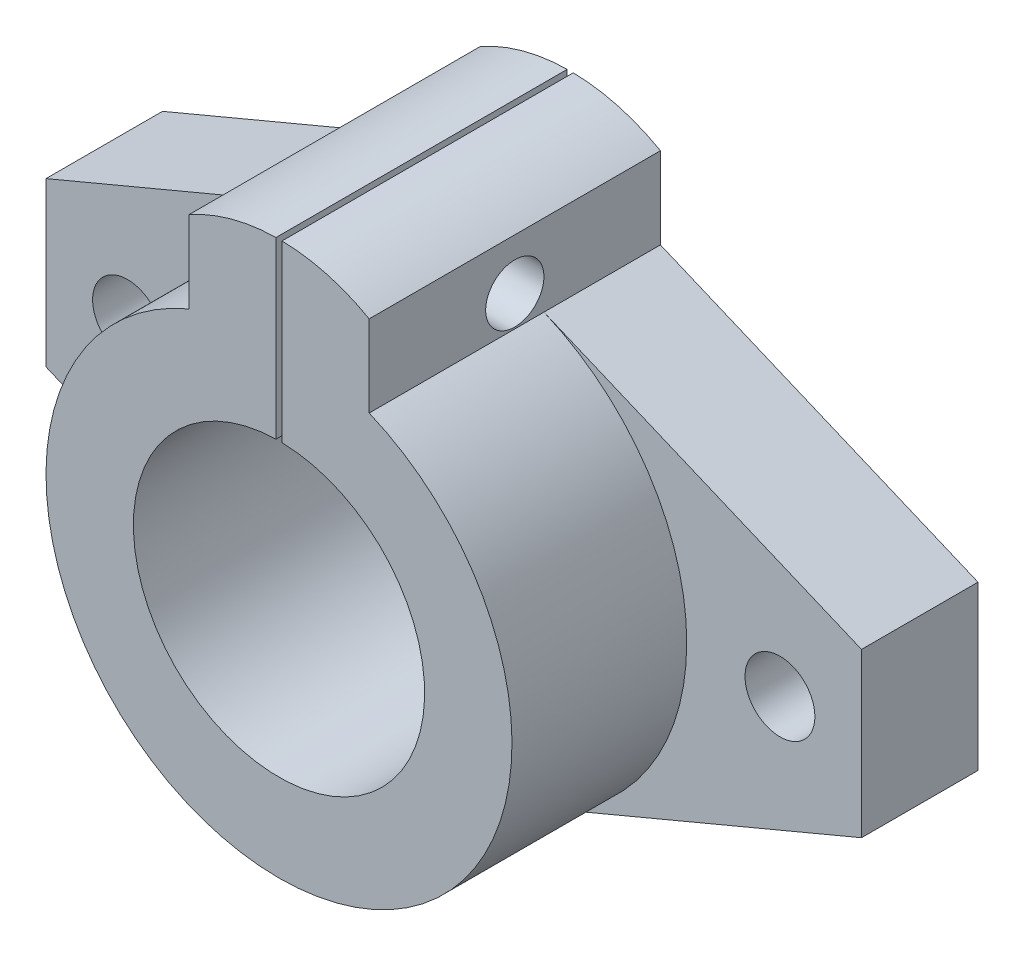
ISO-10303-21;
HEADER;
FILE_DESCRIPTION(('STEP AP214'),'2;1');
FILE_NAME('part.step','',(''),(''),'','','');
FILE_SCHEMA(('AUTOMOTIVE_DESIGN { 1 0 10303 214 1 1 1 1 }'));
ENDSEC;
DATA;
#1=APPLICATION_CONTEXT('core data for automotive mechanical design processes');
#2=APPLICATION_PROTOCOL_DEFINITION('international standard','automotive_design',2000,#1);
#3=PRODUCT_CONTEXT('',#1,'mechanical');
#4=PRODUCT('Part','Part','',(#3));
#5=PRODUCT_RELATED_PRODUCT_CATEGORY('part','',(#4));
#6=PRODUCT_DEFINITION_FORMATION('','',#4);
#7=PRODUCT_DEFINITION_CONTEXT('part definition',#1,'design');
#8=PRODUCT_DEFINITION('design','',#6,#7);
#9=PRODUCT_DEFINITION_SHAPE('','',#8);
#10=(LENGTH_UNIT() NAMED_UNIT(*) SI_UNIT(.MILLI.,.METRE.));
#11=(NAMED_UNIT(*) PLANE_ANGLE_UNIT() SI_UNIT($,.RADIAN.));
#12=(NAMED_UNIT(*) SI_UNIT($,.STERADIAN.) SOLID_ANGLE_UNIT());
#13=UNCERTAINTY_MEASURE_WITH_UNIT(LENGTH_MEASURE(1.E-05),#10,'distance_accuracy_value','');
#14=(GEOMETRIC_REPRESENTATION_CONTEXT(3) GLOBAL_UNCERTAINTY_ASSIGNED_CONTEXT((#13)) GLOBAL_UNIT_ASSIGNED_CONTEXT((#10,
#11,#12)) REPRESENTATION_CONTEXT('',''));
#15=CARTESIAN_POINT('',(0.,0.,0.));
#16=DIRECTION('',(0.,0.,1.));
#17=DIRECTION('',(1.,0.,0.));
#18=AXIS2_PLACEMENT_3D('',#15,#16,#17);
#19=CARTESIAN_POINT('',(0.,11.87489743787,10.));
#20=DIRECTION('',(0.,0.,-1.));
#21=DIRECTION('',(-1.,0.,0.));
#22=AXIS2_PLACEMENT_3D('',#19,#20,#21);
#23=CYLINDRICAL_SURFACE('',#22,15.6193467136848);
#24=DIRECTION('',(0.,0.,-1.));
#25=VECTOR('',#24,1.);
#26=CARTESIAN_POINT('',(-0.258597553957538,27.4921033040735,10.));
#27=LINE('',#26,#25);
#28=CARTESIAN_POINT('',(-0.258597553957538,27.4921033040735,0.));
#29=VERTEX_POINT('',#28);
#30=CARTESIAN_POINT('',(-0.258597553957538,27.4921033040735,25.));
#31=VERTEX_POINT('',#30);
#32=EDGE_CURVE('E59',#29,#31,#27,.F.);
#33=ORIENTED_EDGE('',*,*,#32,.F.);
#34=CARTESIAN_POINT('',(0.,11.87489743787,0.));
#35=DIRECTION('',(0.,0.,1.));
#36=DIRECTION('',(1.,0.,0.));
#37=AXIS2_PLACEMENT_3D('',#34,#35,#36);
#38=CIRCLE('',#37,15.6193467136848);
#39=CARTESIAN_POINT('',(-7.74027571439312,25.441478570472,0.));
#40=VERTEX_POINT('',#39);
#41=EDGE_CURVE('E253',#40,#29,#38,.F.);
#42=ORIENTED_EDGE('',*,*,#41,.F.);
#43=DIRECTION('',(0.,0.,-1.));
#44=VECTOR('',#43,1.);
#45=CARTESIAN_POINT('',(-7.74027571439312,25.441478570472,10.));
#46=LINE('',#45,#44);
#47=CARTESIAN_POINT('',(-7.74027571439312,25.441478570472,25.));
#48=VERTEX_POINT('',#47);
#49=EDGE_CURVE('E229',#48,#40,#46,.T.);
#50=ORIENTED_EDGE('',*,*,#49,.F.);
#51=CARTESIAN_POINT('',(0.,11.8748974378699,25.));
#52=DIRECTION('',(0.,0.,1.));
#53=DIRECTION('',(-1.,0.,0.));
#54=AXIS2_PLACEMENT_3D('',#51,#52,#53);
#55=CIRCLE('',#54,15.6193467136848);
#56=EDGE_CURVE('E164',#31,#48,#55,.T.);
#57=ORIENTED_EDGE('',*,*,#56,.F.);
#58=EDGE_LOOP('',(#33,#42,#50,#57));
#59=FACE_BOUND('',#58,.T.);
#60=ADVANCED_FACE('F36',(#59),#23,.T.);
#61=CARTESIAN_POINT('',(0.,0.,10.));
#62=DIRECTION('',(0.,0.,1.));
#63=DIRECTION('',(1.,0.,0.));
#64=AXIS2_PLACEMENT_3D('',#61,#62,#63);
#65=PLANE('',#64);
#66=CARTESIAN_POINT('',(0.,0.,10.));
#67=DIRECTION('',(0.,0.,1.));
#68=DIRECTION('',(1.,0.,0.));
#69=AXIS2_PLACEMENT_3D('',#66,#67,#68);
#70=CIRCLE('',#69,20.);
#71=CARTESIAN_POINT('',(-7.74027571439312,18.441478570472,10.));
#72=VERTEX_POINT('',#71);
#73=CARTESIAN_POINT('',(-7.74027571439311,-18.441478570472,10.));
#74=VERTEX_POINT('',#73);
#75=EDGE_CURVE('E177',#72,#74,#70,.T.);
#76=ORIENTED_EDGE('',*,*,#75,.F.);
#77=DIRECTION('',(0.922073928523597,0.387013785719656,0.));
#78=VECTOR('',#77,1.);
#79=CARTESIAN_POINT('',(-7.74027571439313,18.441478570472,10.));
#80=LINE('',#79,#78);
#81=CARTESIAN_POINT('',(-35.0000000000568,7.00000000013542,10.));
#82=VERTEX_POINT('',#81);
#83=EDGE_CURVE('E292',#82,#72,#80,.T.);
#84=ORIENTED_EDGE('',*,*,#83,.F.);
#85=DIRECTION('',(0.,1.,0.));
#86=VECTOR('',#85,1.);
#87=CARTESIAN_POINT('',(-35.0000000000568,0.,10.));
#88=LINE('',#87,#86);
#89=CARTESIAN_POINT('',(-35.0000000000568,-7.00000000013543,10.));
#90=VERTEX_POINT('',#89);
#91=EDGE_CURVE('E207',#90,#82,#88,.T.);
#92=ORIENTED_EDGE('',*,*,#91,.F.);
#93=DIRECTION('',(0.922073928523598,-0.387013785719656,0.));
#94=VECTOR('',#93,1.);
#95=CARTESIAN_POINT('',(-7.74027571439311,-18.441478570472,10.));
#96=LINE('',#95,#94);
#97=EDGE_CURVE('E203',#90,#74,#96,.T.);
#98=ORIENTED_EDGE('',*,*,#97,.T.);
#99=EDGE_LOOP('',(#76,#84,#92,#98));
#100=FACE_BOUND('',#99,.T.);
#101=CARTESIAN_POINT('',(-28.,0.,10.));
#102=DIRECTION('',(0.,0.,1.));
#103=DIRECTION('',(1.,0.,0.));
#104=AXIS2_PLACEMENT_3D('',#101,#102,#103);
#105=CIRCLE('',#104,3.);
#106=CARTESIAN_POINT('',(-25.,0.,10.));
#107=VERTEX_POINT('',#106);
#108=EDGE_CURVE('E250',#107,#107,#105,.T.);
#109=ORIENTED_EDGE('',*,*,#108,.F.);
#110=EDGE_LOOP('',(#109));
#111=FACE_BOUND('',#110,.T.);
#112=ADVANCED_FACE('F333',(#100,#111),#65,.T.);
#113=CARTESIAN_POINT('',(7.74027571439313,18.441478570472,10.));
#114=DIRECTION('',(-0.387013785719656,-0.922073928523597,0.));
#115=DIRECTION('',(0.922073928523597,-0.387013785719656,0.));
#116=AXIS2_PLACEMENT_3D('',#113,#114,#115);
#117=PLANE('',#116);
#118=DIRECTION('',(-0.922073928523597,0.387013785719656,0.));
#119=VECTOR('',#118,1.);
#120=CARTESIAN_POINT('',(7.74027571439313,18.441478570472,0.));
#121=LINE('',#120,#119);
#122=CARTESIAN_POINT('',(35.0000000000568,7.00000000013542,0.));
#123=VERTEX_POINT('',#122);
#124=CARTESIAN_POINT('',(7.74027571439312,18.441478570472,0.));
#125=VERTEX_POINT('',#124);
#126=EDGE_CURVE('E176',#123,#125,#121,.T.);
#127=ORIENTED_EDGE('',*,*,#126,.T.);
#128=DIRECTION('',(0.,0.,-1.));
#129=VECTOR('',#128,1.);
#130=CARTESIAN_POINT('',(7.74027571439312,18.441478570472,10.));
#131=LINE('',#130,#129);
#132=CARTESIAN_POINT('',(7.74027571439312,18.441478570472,10.));
#133=VERTEX_POINT('',#132);
#134=EDGE_CURVE('E188',#133,#125,#131,.T.);
#135=ORIENTED_EDGE('',*,*,#134,.F.);
#136=DIRECTION('',(-0.922073928523597,0.387013785719656,0.));
#137=VECTOR('',#136,1.);
#138=CARTESIAN_POINT('',(7.74027571439313,18.441478570472,10.));
#139=LINE('',#138,#137);
#140=CARTESIAN_POINT('',(35.0000000000568,7.00000000013542,10.));
#141=VERTEX_POINT('',#140);
#142=EDGE_CURVE('E183',#141,#133,#139,.T.);
#143=ORIENTED_EDGE('',*,*,#142,.F.);
#144=DIRECTION('',(0.,0.,-1.));
#145=VECTOR('',#144,1.);
#146=CARTESIAN_POINT('',(35.0000000000568,7.00000000013542,10.));
#147=LINE('',#146,#145);
#148=EDGE_CURVE('E244',#141,#123,#147,.T.);
#149=ORIENTED_EDGE('',*,*,#148,.T.);
#150=EDGE_LOOP('',(#127,#135,#143,#149));
#151=FACE_BOUND('',#150,.T.);
#152=ADVANCED_FACE('F38',(#151),#117,.F.);
#153=CARTESIAN_POINT('',(7.74027571439312,0.,10.));
#154=DIRECTION('',(-1.,0.,0.));
#155=DIRECTION('',(0.,0.,1.));
#156=AXIS2_PLACEMENT_3D('',#153,#154,#155);
#157=PLANE('',#156);
#158=CARTESIAN_POINT('',(7.74027571439312,21.0864235760214,12.5));
#159=DIRECTION('',(1.,0.,0.));
#160=DIRECTION('',(0.,0.,-1.));
#161=AXIS2_PLACEMENT_3D('',#158,#159,#160);
#162=CIRCLE('',#161,2.5);
#163=CARTESIAN_POINT('',(7.74027571439312,21.0864235760214,10.));
#164=VERTEX_POINT('',#163);
#165=EDGE_CURVE('E363',#164,#164,#162,.T.);
#166=ORIENTED_EDGE('',*,*,#165,.F.);
#167=EDGE_LOOP('',(#166));
#168=FACE_BOUND('',#167,.T.);
#169=DIRECTION('',(0.,1.,0.));
#170=VECTOR('',#169,1.);
#171=CARTESIAN_POINT('',(7.74027571439312,0.,0.));
#172=LINE('',#171,#170);
#173=CARTESIAN_POINT('',(7.74027571439312,25.441478570472,0.));
#174=VERTEX_POINT('',#173);
#175=EDGE_CURVE('E236',#125,#174,#172,.T.);
#176=ORIENTED_EDGE('',*,*,#175,.T.);
#177=DIRECTION('',(0.,0.,-1.));
#178=VECTOR('',#177,1.);
#179=CARTESIAN_POINT('',(7.74027571439312,25.441478570472,10.));
#180=LINE('',#179,#178);
#181=CARTESIAN_POINT('',(7.74027571439312,25.441478570472,25.));
#182=VERTEX_POINT('',#181);
#183=EDGE_CURVE('E230',#182,#174,#180,.T.);
#184=ORIENTED_EDGE('',*,*,#183,.F.);
#185=DIRECTION('',(0.,1.,0.));
#186=VECTOR('',#185,1.);
#187=CARTESIAN_POINT('',(7.74027571439312,18.441478570472,25.));
#188=LINE('',#187,#186);
#189=CARTESIAN_POINT('',(7.74027571439312,18.441478570472,25.));
#190=VERTEX_POINT('',#189);
#191=EDGE_CURVE('E162',#190,#182,#188,.T.);
#192=ORIENTED_EDGE('',*,*,#191,.F.);
#193=DIRECTION('',(0.,0.,-1.));
#194=VECTOR('',#193,1.);
#195=CARTESIAN_POINT('',(7.74027571439312,18.441478570472,25.));
#196=LINE('',#195,#194);
#197=EDGE_CURVE('E173',#190,#133,#196,.T.);
#198=ORIENTED_EDGE('',*,*,#197,.T.);
#199=ORIENTED_EDGE('',*,*,#134,.T.);
#200=EDGE_LOOP('',(#176,#184,#192,#198,#199));
#201=FACE_BOUND('',#200,.T.);
#202=ADVANCED_FACE('F235',(#168,#201),#157,.F.);
#203=DIRECTION('',(0.,0.,-1.));
#204=VECTOR('',#203,1.);
#205=CARTESIAN_POINT('',(0.258597553957538,27.4921033040735,10.));
#206=LINE('',#205,#204);
#207=CARTESIAN_POINT('',(0.258597553957538,27.4921033040735,25.));
#208=VERTEX_POINT('',#207);
#209=CARTESIAN_POINT('',(0.258597553957538,27.4921033040735,0.));
#210=VERTEX_POINT('',#209);
#211=EDGE_CURVE('E142',#208,#210,#206,.T.);
#212=ORIENTED_EDGE('',*,*,#211,.F.);
#213=EDGE_CURVE('E155',#182,#208,#55,.T.);
#214=ORIENTED_EDGE('',*,*,#213,.F.);
#215=ORIENTED_EDGE('',*,*,#183,.T.);
#216=EDGE_CURVE('E156',#210,#174,#38,.F.);
#217=ORIENTED_EDGE('',*,*,#216,.F.);
#218=EDGE_LOOP('',(#212,#214,#215,#217));
#219=FACE_BOUND('',#218,.T.);
#220=ADVANCED_FACE('F153',(#219),#23,.T.);
#221=CARTESIAN_POINT('',(-7.74027571439312,0.,10.));
#222=DIRECTION('',(-1.,0.,0.));
#223=DIRECTION('',(0.,0.,1.));
#224=AXIS2_PLACEMENT_3D('',#221,#222,#223);
#225=PLANE('',#224);
#226=CARTESIAN_POINT('',(-7.74027571439312,21.0864235760214,12.5));
#227=DIRECTION('',(-1.,0.,0.));
#228=DIRECTION('',(0.,0.,1.));
#229=AXIS2_PLACEMENT_3D('',#226,#227,#228);
#230=CIRCLE('',#229,2.5);
#231=CARTESIAN_POINT('',(-7.74027571439312,21.0864235760214,15.));
#232=VERTEX_POINT('',#231);
#233=EDGE_CURVE('E371',#232,#232,#230,.T.);
#234=ORIENTED_EDGE('',*,*,#233,.F.);
#235=EDGE_LOOP('',(#234));
#236=FACE_BOUND('',#235,.T.);
#237=DIRECTION('',(0.,1.,0.));
#238=VECTOR('',#237,1.);
#239=CARTESIAN_POINT('',(-7.74027571439312,0.,0.));
#240=LINE('',#239,#238);
#241=CARTESIAN_POINT('',(-7.74027571439312,18.441478570472,0.));
#242=VERTEX_POINT('',#241);
#243=EDGE_CURVE('E256',#242,#40,#240,.T.);
#244=ORIENTED_EDGE('',*,*,#243,.F.);
#245=DIRECTION('',(0.,0.,-1.));
#246=VECTOR('',#245,1.);
#247=CARTESIAN_POINT('',(-7.74027571439312,18.441478570472,10.));
#248=LINE('',#247,#246);
#249=EDGE_CURVE('E223',#72,#242,#248,.T.);
#250=ORIENTED_EDGE('',*,*,#249,.F.);
#251=DIRECTION('',(0.,0.,-1.));
#252=VECTOR('',#251,1.);
#253=CARTESIAN_POINT('',(-7.74027571439312,18.441478570472,25.));
#254=LINE('',#253,#252);
#255=CARTESIAN_POINT('',(-7.74027571439312,18.441478570472,25.));
#256=VERTEX_POINT('',#255);
#257=EDGE_CURVE('E166',#256,#72,#254,.T.);
#258=ORIENTED_EDGE('',*,*,#257,.F.);
#259=DIRECTION('',(0.,-1.,0.));
#260=VECTOR('',#259,1.);
#261=CARTESIAN_POINT('',(-7.74027571439312,18.441478570472,25.));
#262=LINE('',#261,#260);
#263=EDGE_CURVE('E163',#48,#256,#262,.T.);
#264=ORIENTED_EDGE('',*,*,#263,.F.);
#265=ORIENTED_EDGE('',*,*,#49,.T.);
#266=EDGE_LOOP('',(#244,#250,#258,#264,#265));
#267=FACE_BOUND('',#266,.T.);
#268=ADVANCED_FACE('F321',(#236,#267),#225,.T.);
#269=CARTESIAN_POINT('',(-7.74027571439313,18.441478570472,10.));
#270=DIRECTION('',(-0.387013785719656,0.922073928523597,0.));
#271=DIRECTION('',(-0.922073928523597,-0.387013785719656,0.));
#272=AXIS2_PLACEMENT_3D('',#269,#270,#271);
#273=PLANE('',#272);
#274=DIRECTION('',(0.922073928523597,0.387013785719656,0.));
#275=VECTOR('',#274,1.);
#276=CARTESIAN_POINT('',(-7.74027571439313,18.441478570472,0.));
#277=LINE('',#276,#275);
#278=CARTESIAN_POINT('',(-35.0000000000568,7.00000000013542,0.));
#279=VERTEX_POINT('',#278);
#280=EDGE_CURVE('E259',#279,#242,#277,.T.);
#281=ORIENTED_EDGE('',*,*,#280,.F.);
#282=DIRECTION('',(0.,0.,-1.));
#283=VECTOR('',#282,1.);
#284=CARTESIAN_POINT('',(-35.0000000000568,7.00000000013542,10.));
#285=LINE('',#284,#283);
#286=EDGE_CURVE('E218',#82,#279,#285,.T.);
#287=ORIENTED_EDGE('',*,*,#286,.F.);
#288=ORIENTED_EDGE('',*,*,#83,.T.);
#289=ORIENTED_EDGE('',*,*,#249,.T.);
#290=EDGE_LOOP('',(#281,#287,#288,#289));
#291=FACE_BOUND('',#290,.T.);
#292=ADVANCED_FACE('F315',(#291),#273,.T.);
#293=CARTESIAN_POINT('',(-35.0000000000568,0.,10.));
#294=DIRECTION('',(-1.,0.,0.));
#295=DIRECTION('',(0.,0.,1.));
#296=AXIS2_PLACEMENT_3D('',#293,#294,#295);
#297=PLANE('',#296);
#298=DIRECTION('',(0.,1.,0.));
#299=VECTOR('',#298,1.);
#300=CARTESIAN_POINT('',(-35.0000000000568,0.,0.));
#301=LINE('',#300,#299);
#302=CARTESIAN_POINT('',(-35.0000000000568,-7.00000000013543,0.));
#303=VERTEX_POINT('',#302);
#304=EDGE_CURVE('E262',#303,#279,#301,.T.);
#305=ORIENTED_EDGE('',*,*,#304,.F.);
#306=DIRECTION('',(0.,0.,-1.));
#307=VECTOR('',#306,1.);
#308=CARTESIAN_POINT('',(-35.0000000000568,-7.00000000013543,10.));
#309=LINE('',#308,#307);
#310=EDGE_CURVE('E212',#90,#303,#309,.T.);
#311=ORIENTED_EDGE('',*,*,#310,.F.);
#312=ORIENTED_EDGE('',*,*,#91,.T.);
#313=ORIENTED_EDGE('',*,*,#286,.T.);
#314=EDGE_LOOP('',(#305,#311,#312,#313));
#315=FACE_BOUND('',#314,.T.);
#316=ADVANCED_FACE('F312',(#315),#297,.T.);
#317=CARTESIAN_POINT('',(-7.74027571439311,-18.441478570472,10.));
#318=DIRECTION('',(0.387013785719656,0.922073928523598,0.));
#319=DIRECTION('',(-0.922073928523598,0.387013785719656,0.));
#320=AXIS2_PLACEMENT_3D('',#317,#318,#319);
#321=PLANE('',#320);
#322=DIRECTION('',(0.922073928523598,-0.387013785719656,0.));
#323=VECTOR('',#322,1.);
#324=CARTESIAN_POINT('',(-7.74027571439311,-18.441478570472,0.));
#325=LINE('',#324,#323);
#326=CARTESIAN_POINT('',(-7.74027571439311,-18.441478570472,0.));
#327=VERTEX_POINT('',#326);
#328=EDGE_CURVE('E265',#303,#327,#325,.T.);
#329=ORIENTED_EDGE('',*,*,#328,.T.);
#330=DIRECTION('',(0.,0.,-1.));
#331=VECTOR('',#330,1.);
#332=CARTESIAN_POINT('',(-7.74027571439311,-18.441478570472,10.));
#333=LINE('',#332,#331);
#334=EDGE_CURVE('E195',#74,#327,#333,.T.);
#335=ORIENTED_EDGE('',*,*,#334,.F.);
#336=ORIENTED_EDGE('',*,*,#97,.F.);
#337=ORIENTED_EDGE('',*,*,#310,.T.);
#338=EDGE_LOOP('',(#329,#335,#336,#337));
#339=FACE_BOUND('',#338,.T.);
#340=ADVANCED_FACE('F335',(#339),#321,.F.);
#341=CARTESIAN_POINT('',(0.,0.,10.));
#342=DIRECTION('',(0.,0.,-1.));
#343=DIRECTION('',(-1.,0.,0.));
#344=AXIS2_PLACEMENT_3D('',#341,#342,#343);
#345=CYLINDRICAL_SURFACE('',#344,20.);
#346=CARTESIAN_POINT('',(0.,0.,0.));
#347=DIRECTION('',(0.,0.,1.));
#348=DIRECTION('',(1.,0.,0.));
#349=AXIS2_PLACEMENT_3D('',#346,#347,#348);
#350=CIRCLE('',#349,20.);
#351=CARTESIAN_POINT('',(7.74027571439311,-18.441478570472,0.));
#352=VERTEX_POINT('',#351);
#353=EDGE_CURVE('E267',#327,#352,#350,.T.);
#354=ORIENTED_EDGE('',*,*,#353,.T.);
#355=DIRECTION('',(0.,0.,-1.));
#356=VECTOR('',#355,1.);
#357=CARTESIAN_POINT('',(7.74027571439311,-18.441478570472,10.));
#358=LINE('',#357,#356);
#359=CARTESIAN_POINT('',(7.74027571439311,-18.441478570472,10.));
#360=VERTEX_POINT('',#359);
#361=EDGE_CURVE('E193',#360,#352,#358,.T.);
#362=ORIENTED_EDGE('',*,*,#361,.F.);
#363=EDGE_CURVE('E148',#360,#133,#70,.T.);
#364=ORIENTED_EDGE('',*,*,#363,.T.);
#365=ORIENTED_EDGE('',*,*,#197,.F.);
#366=CARTESIAN_POINT('',(0.,0.,25.));
#367=DIRECTION('',(0.,0.,1.));
#368=DIRECTION('',(1.,0.,0.));
#369=AXIS2_PLACEMENT_3D('',#366,#367,#368);
#370=CIRCLE('',#369,20.);
#371=EDGE_CURVE('E181',#256,#190,#370,.T.);
#372=ORIENTED_EDGE('',*,*,#371,.F.);
#373=ORIENTED_EDGE('',*,*,#257,.T.);
#374=ORIENTED_EDGE('',*,*,#75,.T.);
#375=ORIENTED_EDGE('',*,*,#334,.T.);
#376=EDGE_LOOP('',(#354,#362,#364,#365,#372,#373,#374,#375));
#377=FACE_BOUND('',#376,.T.);
#378=ADVANCED_FACE('F301',(#377),#345,.T.);
#379=CARTESIAN_POINT('',(7.74027571439311,-18.441478570472,10.));
#380=DIRECTION('',(0.387013785719656,-0.922073928523598,0.));
#381=DIRECTION('',(0.922073928523598,0.387013785719656,0.));
#382=AXIS2_PLACEMENT_3D('',#379,#380,#381);
#383=PLANE('',#382);
#384=DIRECTION('',(-0.922073928523598,-0.387013785719656,0.));
#385=VECTOR('',#384,1.);
#386=CARTESIAN_POINT('',(7.74027571439311,-18.441478570472,0.));
#387=LINE('',#386,#385);
#388=CARTESIAN_POINT('',(35.0000000000568,-7.00000000013543,0.));
#389=VERTEX_POINT('',#388);
#390=EDGE_CURVE('E269',#389,#352,#387,.T.);
#391=ORIENTED_EDGE('',*,*,#390,.F.);
#392=DIRECTION('',(0.,0.,-1.));
#393=VECTOR('',#392,1.);
#394=CARTESIAN_POINT('',(35.0000000000568,-7.00000000013543,10.));
#395=LINE('',#394,#393);
#396=CARTESIAN_POINT('',(35.0000000000568,-7.00000000013543,10.));
#397=VERTEX_POINT('',#396);
#398=EDGE_CURVE('E196',#397,#389,#395,.T.);
#399=ORIENTED_EDGE('',*,*,#398,.F.);
#400=DIRECTION('',(-0.922073928523598,-0.387013785719656,0.));
#401=VECTOR('',#400,1.);
#402=CARTESIAN_POINT('',(7.74027571439311,-18.441478570472,10.));
#403=LINE('',#402,#401);
#404=EDGE_CURVE('E199',#397,#360,#403,.T.);
#405=ORIENTED_EDGE('',*,*,#404,.T.);
#406=ORIENTED_EDGE('',*,*,#361,.T.);
#407=EDGE_LOOP('',(#391,#399,#405,#406));
#408=FACE_BOUND('',#407,.T.);
#409=ADVANCED_FACE('F305',(#408),#383,.T.);
#410=CARTESIAN_POINT('',(0.,0.,10.));
#411=DIRECTION('',(0.,0.,-1.));
#412=DIRECTION('',(-1.,0.,0.));
#413=AXIS2_PLACEMENT_3D('',#410,#411,#412);
#414=CYLINDRICAL_SURFACE('',#413,12.5);
#415=DIRECTION('',(0.,0.,-1.));
#416=VECTOR('',#415,1.);
#417=CARTESIAN_POINT('',(-0.258597553957538,12.497324805937,10.));
#418=LINE('',#417,#416);
#419=CARTESIAN_POINT('',(-0.258597553957538,12.497324805937,25.));
#420=VERTEX_POINT('',#419);
#421=CARTESIAN_POINT('',(-0.258597553957538,12.497324805937,0.));
#422=VERTEX_POINT('',#421);
#423=EDGE_CURVE('E327',#420,#422,#418,.T.);
#424=ORIENTED_EDGE('',*,*,#423,.F.);
#425=CARTESIAN_POINT('',(0.,0.,25.));
#426=DIRECTION('',(0.,0.,1.));
#427=DIRECTION('',(1.,0.,0.));
#428=AXIS2_PLACEMENT_3D('',#425,#426,#427);
#429=CIRCLE('',#428,12.5);
#430=CARTESIAN_POINT('',(0.258597553957538,12.497324805937,25.));
#431=VERTEX_POINT('',#430);
#432=EDGE_CURVE('E182',#420,#431,#429,.T.);
#433=ORIENTED_EDGE('',*,*,#432,.T.);
#434=DIRECTION('',(0.,0.,-1.));
#435=VECTOR('',#434,1.);
#436=CARTESIAN_POINT('',(0.258597553957538,12.497324805937,10.));
#437=LINE('',#436,#435);
#438=CARTESIAN_POINT('',(0.258597553957538,12.497324805937,0.));
#439=VERTEX_POINT('',#438);
#440=EDGE_CURVE('E52',#439,#431,#437,.F.);
#441=ORIENTED_EDGE('',*,*,#440,.F.);
#442=CARTESIAN_POINT('',(0.,0.,0.));
#443=DIRECTION('',(0.,0.,1.));
#444=DIRECTION('',(1.,0.,0.));
#445=AXIS2_PLACEMENT_3D('',#442,#443,#444);
#446=CIRCLE('',#445,12.5);
#447=EDGE_CURVE('E277',#422,#439,#446,.T.);
#448=ORIENTED_EDGE('',*,*,#447,.F.);
#449=EDGE_LOOP('',(#424,#433,#441,#448));
#450=FACE_BOUND('',#449,.T.);
#451=ADVANCED_FACE('F379',(#450),#414,.F.);
#452=CARTESIAN_POINT('',(28.,0.,10.));
#453=DIRECTION('',(0.,0.,-1.));
#454=DIRECTION('',(-1.,0.,0.));
#455=AXIS2_PLACEMENT_3D('',#452,#453,#454);
#456=CYLINDRICAL_SURFACE('',#455,3.);
#457=CARTESIAN_POINT('',(28.,0.,10.));
#458=DIRECTION('',(0.,0.,1.));
#459=DIRECTION('',(1.,0.,0.));
#460=AXIS2_PLACEMENT_3D('',#457,#458,#459);
#461=CIRCLE('',#460,3.);
#462=CARTESIAN_POINT('',(31.,0.,10.));
#463=VERTEX_POINT('',#462);
#464=EDGE_CURVE('E283',#463,#463,#461,.F.);
#465=ORIENTED_EDGE('',*,*,#464,.F.);
#466=EDGE_LOOP('',(#465));
#467=FACE_BOUND('',#466,.T.);
#468=CARTESIAN_POINT('',(28.,0.,0.));
#469=DIRECTION('',(0.,0.,1.));
#470=DIRECTION('',(1.,0.,0.));
#471=AXIS2_PLACEMENT_3D('',#468,#469,#470);
#472=CIRCLE('',#471,3.);
#473=CARTESIAN_POINT('',(31.,0.,0.));
#474=VERTEX_POINT('',#473);
#475=EDGE_CURVE('E274',#474,#474,#472,.F.);
#476=ORIENTED_EDGE('',*,*,#475,.T.);
#477=EDGE_LOOP('',(#476));
#478=FACE_BOUND('',#477,.T.);
#479=ADVANCED_FACE('F406',(#467,#478),#456,.F.);
#480=CARTESIAN_POINT('',(35.0000000000568,0.,10.));
#481=DIRECTION('',(-1.,0.,0.));
#482=DIRECTION('',(0.,0.,1.));
#483=AXIS2_PLACEMENT_3D('',#480,#481,#482);
#484=PLANE('',#483);
#485=DIRECTION('',(0.,1.,0.));
#486=VECTOR('',#485,1.);
#487=CARTESIAN_POINT('',(35.0000000000568,0.,0.));
#488=LINE('',#487,#486);
#489=EDGE_CURVE('E272',#389,#123,#488,.T.);
#490=ORIENTED_EDGE('',*,*,#489,.T.);
#491=ORIENTED_EDGE('',*,*,#148,.F.);
#492=DIRECTION('',(0.,1.,0.));
#493=VECTOR('',#492,1.);
#494=CARTESIAN_POINT('',(35.0000000000568,0.,10.));
#495=LINE('',#494,#493);
#496=EDGE_CURVE('E202',#397,#141,#495,.T.);
#497=ORIENTED_EDGE('',*,*,#496,.F.);
#498=ORIENTED_EDGE('',*,*,#398,.T.);
#499=EDGE_LOOP('',(#490,#491,#497,#498));
#500=FACE_BOUND('',#499,.T.);
#501=ADVANCED_FACE('F307',(#500),#484,.F.);
#502=CARTESIAN_POINT('',(-28.,0.,10.));
#503=DIRECTION('',(0.,0.,-1.));
#504=DIRECTION('',(-1.,0.,0.));
#505=AXIS2_PLACEMENT_3D('',#502,#503,#504);
#506=CYLINDRICAL_SURFACE('',#505,3.);
#507=ORIENTED_EDGE('',*,*,#108,.T.);
#508=EDGE_LOOP('',(#507));
#509=FACE_BOUND('',#508,.T.);
#510=CARTESIAN_POINT('',(-28.,0.,0.));
#511=DIRECTION('',(0.,0.,1.));
#512=DIRECTION('',(1.,0.,0.));
#513=AXIS2_PLACEMENT_3D('',#510,#511,#512);
#514=CIRCLE('',#513,3.);
#515=CARTESIAN_POINT('',(-25.,0.,0.));
#516=VERTEX_POINT('',#515);
#517=EDGE_CURVE('E280',#516,#516,#514,.T.);
#518=ORIENTED_EDGE('',*,*,#517,.F.);
#519=EDGE_LOOP('',(#518));
#520=FACE_BOUND('',#519,.T.);
#521=ADVANCED_FACE('F398',(#509,#520),#506,.F.);
#522=ORIENTED_EDGE('',*,*,#363,.F.);
#523=ORIENTED_EDGE('',*,*,#404,.F.);
#524=ORIENTED_EDGE('',*,*,#496,.T.);
#525=ORIENTED_EDGE('',*,*,#142,.T.);
#526=EDGE_LOOP('',(#522,#523,#524,#525));
#527=FACE_BOUND('',#526,.T.);
#528=ORIENTED_EDGE('',*,*,#464,.T.);
#529=EDGE_LOOP('',(#528));
#530=FACE_BOUND('',#529,.T.);
#531=ADVANCED_FACE('F297',(#527,#530),#65,.T.);
#532=CARTESIAN_POINT('',(0.,0.,0.));
#533=DIRECTION('',(0.,0.,1.));
#534=DIRECTION('',(1.,0.,0.));
#535=AXIS2_PLACEMENT_3D('',#532,#533,#534);
#536=PLANE('',#535);
#537=ORIENTED_EDGE('',*,*,#475,.F.);
#538=EDGE_LOOP('',(#537));
#539=FACE_BOUND('',#538,.T.);
#540=ORIENTED_EDGE('',*,*,#41,.T.);
#541=DIRECTION('',(0.,-1.,0.));
#542=VECTOR('',#541,1.);
#543=CARTESIAN_POINT('',(-0.258597553957538,0.,0.));
#544=LINE('',#543,#542);
#545=EDGE_CURVE('E157',#29,#422,#544,.T.);
#546=ORIENTED_EDGE('',*,*,#545,.T.);
#547=ORIENTED_EDGE('',*,*,#447,.T.);
#548=DIRECTION('',(0.,1.,0.));
#549=VECTOR('',#548,1.);
#550=CARTESIAN_POINT('',(0.258597553957538,0.,0.));
#551=LINE('',#550,#549);
#552=EDGE_CURVE('E374',#439,#210,#551,.T.);
#553=ORIENTED_EDGE('',*,*,#552,.T.);
#554=ORIENTED_EDGE('',*,*,#216,.T.);
#555=ORIENTED_EDGE('',*,*,#175,.F.);
#556=ORIENTED_EDGE('',*,*,#126,.F.);
#557=ORIENTED_EDGE('',*,*,#489,.F.);
#558=ORIENTED_EDGE('',*,*,#390,.T.);
#559=ORIENTED_EDGE('',*,*,#353,.F.);
#560=ORIENTED_EDGE('',*,*,#328,.F.);
#561=ORIENTED_EDGE('',*,*,#304,.T.);
#562=ORIENTED_EDGE('',*,*,#280,.T.);
#563=ORIENTED_EDGE('',*,*,#243,.T.);
#564=EDGE_LOOP('',(#540,#546,#547,#553,#554,#555,#556,#557,#558,#559,#560,#561,#562,#563));
#565=FACE_BOUND('',#564,.T.);
#566=ORIENTED_EDGE('',*,*,#517,.T.);
#567=EDGE_LOOP('',(#566));
#568=FACE_BOUND('',#567,.T.);
#569=ADVANCED_FACE('F308',(#539,#565,#568),#536,.F.);
#570=CARTESIAN_POINT('',(0.,0.,25.));
#571=DIRECTION('',(0.,0.,1.));
#572=DIRECTION('',(1.,0.,0.));
#573=AXIS2_PLACEMENT_3D('',#570,#571,#572);
#574=PLANE('',#573);
#575=DIRECTION('',(0.,-1.,0.));
#576=VECTOR('',#575,1.);
#577=CARTESIAN_POINT('',(-0.258597553957538,0.,25.));
#578=LINE('',#577,#576);
#579=EDGE_CURVE('E11',#31,#420,#578,.T.);
#580=ORIENTED_EDGE('',*,*,#579,.F.);
#581=ORIENTED_EDGE('',*,*,#56,.T.);
#582=ORIENTED_EDGE('',*,*,#263,.T.);
#583=ORIENTED_EDGE('',*,*,#371,.T.);
#584=ORIENTED_EDGE('',*,*,#191,.T.);
#585=ORIENTED_EDGE('',*,*,#213,.T.);
#586=DIRECTION('',(0.,1.,0.));
#587=VECTOR('',#586,1.);
#588=CARTESIAN_POINT('',(0.258597553957538,0.,25.));
#589=LINE('',#588,#587);
#590=EDGE_CURVE('E45',#431,#208,#589,.T.);
#591=ORIENTED_EDGE('',*,*,#590,.F.);
#592=ORIENTED_EDGE('',*,*,#432,.F.);
#593=EDGE_LOOP('',(#580,#581,#582,#583,#584,#585,#591,#592));
#594=FACE_BOUND('',#593,.T.);
#595=ADVANCED_FACE('F160',(#594),#574,.T.);
#596=CARTESIAN_POINT('',(0.258597553957538,12.3781063786396,-2.50000000007189E-05));
#597=DIRECTION('',(1.,0.,0.));
#598=DIRECTION('',(0.,0.,-1.));
#599=AXIS2_PLACEMENT_3D('',#596,#597,#598);
#600=PLANE('',#599);
#601=CARTESIAN_POINT('',(0.258597553957539,21.0864235760214,12.5));
#602=DIRECTION('',(1.,0.,0.));
#603=DIRECTION('',(0.,0.,-1.));
#604=AXIS2_PLACEMENT_3D('',#601,#602,#603);
#605=CIRCLE('',#604,2.5);
#606=CARTESIAN_POINT('',(0.258597553957539,21.0864235760214,10.));
#607=VERTEX_POINT('',#606);
#608=EDGE_CURVE('E367',#607,#607,#605,.T.);
#609=ORIENTED_EDGE('',*,*,#608,.T.);
#610=EDGE_LOOP('',(#609));
#611=FACE_BOUND('',#610,.T.);
#612=ORIENTED_EDGE('',*,*,#211,.T.);
#613=ORIENTED_EDGE('',*,*,#552,.F.);
#614=ORIENTED_EDGE('',*,*,#440,.T.);
#615=ORIENTED_EDGE('',*,*,#590,.T.);
#616=EDGE_LOOP('',(#612,#613,#614,#615));
#617=FACE_BOUND('',#616,.T.);
#618=ADVANCED_FACE('F141',(#611,#617),#600,.F.);
#619=CARTESIAN_POINT('',(-0.258597553957538,12.3781063786396,-2.50000000007189E-05));
#620=DIRECTION('',(-1.,0.,0.));
#621=DIRECTION('',(0.,0.,1.));
#622=AXIS2_PLACEMENT_3D('',#619,#620,#621);
#623=PLANE('',#622);
#624=CARTESIAN_POINT('',(-0.258597553957539,21.0864235760214,12.5));
#625=DIRECTION('',(-1.,0.,0.));
#626=DIRECTION('',(0.,0.,1.));
#627=AXIS2_PLACEMENT_3D('',#624,#625,#626);
#628=CIRCLE('',#627,2.5);
#629=CARTESIAN_POINT('',(-0.258597553957539,21.0864235760214,15.));
#630=VERTEX_POINT('',#629);
#631=EDGE_CURVE('E40',#630,#630,#628,.T.);
#632=ORIENTED_EDGE('',*,*,#631,.T.);
#633=EDGE_LOOP('',(#632));
#634=FACE_BOUND('',#633,.T.);
#635=ORIENTED_EDGE('',*,*,#32,.T.);
#636=ORIENTED_EDGE('',*,*,#579,.T.);
#637=ORIENTED_EDGE('',*,*,#423,.T.);
#638=ORIENTED_EDGE('',*,*,#545,.F.);
#639=EDGE_LOOP('',(#635,#636,#637,#638));
#640=FACE_BOUND('',#639,.T.);
#641=ADVANCED_FACE('F380',(#634,#640),#623,.F.);
#642=CARTESIAN_POINT('',(-35.0000250000568,21.0864235760214,12.5));
#643=DIRECTION('',(1.,0.,0.));
#644=DIRECTION('',(0.,0.,-1.));
#645=AXIS2_PLACEMENT_3D('',#642,#643,#644);
#646=CYLINDRICAL_SURFACE('',#645,2.5);
#647=ORIENTED_EDGE('',*,*,#233,.T.);
#648=EDGE_LOOP('',(#647));
#649=FACE_BOUND('',#648,.T.);
#650=ORIENTED_EDGE('',*,*,#631,.F.);
#651=EDGE_LOOP('',(#650));
#652=FACE_BOUND('',#651,.T.);
#653=ADVANCED_FACE('F382',(#649,#652),#646,.F.);
#654=ORIENTED_EDGE('',*,*,#165,.T.);
#655=EDGE_LOOP('',(#654));
#656=FACE_BOUND('',#655,.T.);
#657=ORIENTED_EDGE('',*,*,#608,.F.);
#658=EDGE_LOOP('',(#657));
#659=FACE_BOUND('',#658,.T.);
#660=ADVANCED_FACE('F389',(#656,#659),#646,.F.);
#661=CLOSED_SHELL('',(#60,#112,#152,#202,#220,#268,#292,#316,#340,#378,#409,#451,#479,#501,#521,
#531,#569,#595,#618,#641,#653,#660));
#662=MANIFOLD_SOLID_BREP('B2',#661);
#663=ADVANCED_BREP_SHAPE_REPRESENTATION('',(#18,#662),#14);
#664=SHAPE_DEFINITION_REPRESENTATION(#9,#663);
ENDSEC;
END-ISO-10303-21;
